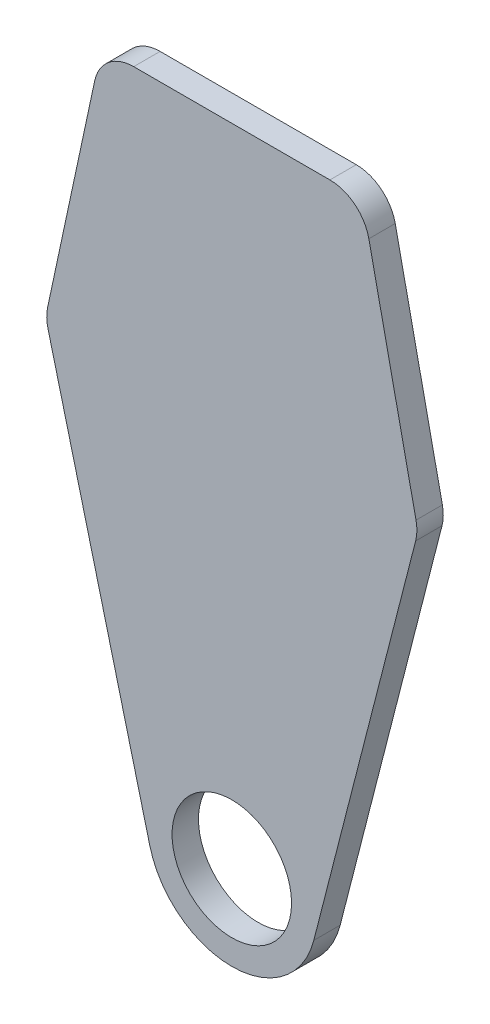
ISO-10303-21;
HEADER;
FILE_DESCRIPTION(('STEP AP214'),'2;1');
FILE_NAME('part.step','',(''),(''),'','','');
FILE_SCHEMA(('AUTOMOTIVE_DESIGN { 1 0 10303 214 1 1 1 1 }'));
ENDSEC;
DATA;
#1=APPLICATION_CONTEXT('core data for automotive mechanical design processes');
#2=APPLICATION_PROTOCOL_DEFINITION('international standard','automotive_design',2000,#1);
#3=PRODUCT_CONTEXT('',#1,'mechanical');
#4=PRODUCT('Part','Part','',(#3));
#5=PRODUCT_RELATED_PRODUCT_CATEGORY('part','',(#4));
#6=PRODUCT_DEFINITION_FORMATION('','',#4);
#7=PRODUCT_DEFINITION_CONTEXT('part definition',#1,'design');
#8=PRODUCT_DEFINITION('design','',#6,#7);
#9=PRODUCT_DEFINITION_SHAPE('','',#8);
#10=(LENGTH_UNIT() NAMED_UNIT(*) SI_UNIT(.MILLI.,.METRE.));
#11=(NAMED_UNIT(*) PLANE_ANGLE_UNIT() SI_UNIT($,.RADIAN.));
#12=(NAMED_UNIT(*) SI_UNIT($,.STERADIAN.) SOLID_ANGLE_UNIT());
#13=UNCERTAINTY_MEASURE_WITH_UNIT(LENGTH_MEASURE(1.E-05),#10,'distance_accuracy_value','');
#14=(GEOMETRIC_REPRESENTATION_CONTEXT(3) GLOBAL_UNCERTAINTY_ASSIGNED_CONTEXT((#13)) GLOBAL_UNIT_ASSIGNED_CONTEXT((#10,
#11,#12)) REPRESENTATION_CONTEXT('',''));
#15=CARTESIAN_POINT('',(0.,0.,0.));
#16=DIRECTION('',(0.,0.,1.));
#17=DIRECTION('',(1.,0.,0.));
#18=AXIS2_PLACEMENT_3D('',#15,#16,#17);
#19=CARTESIAN_POINT('',(0.,0.,6.731));
#20=DIRECTION('',(0.,0.,1.));
#21=DIRECTION('',(1.,0.,0.));
#22=AXIS2_PLACEMENT_3D('',#19,#20,#21);
#23=PLANE('',#22);
#24=DIRECTION('',(1.,0.,0.));
#25=VECTOR('',#24,1.);
#26=CARTESIAN_POINT('',(-33.2359,164.676666666667,6.731));
#27=LINE('',#26,#25);
#28=CARTESIAN_POINT('',(-25.0221764756321,164.676666666667,6.731));
#29=VERTEX_POINT('',#28);
#30=CARTESIAN_POINT('',(25.0221764756321,164.676666666667,6.731));
#31=VERTEX_POINT('',#30);
#32=EDGE_CURVE('E197',#29,#31,#27,.T.);
#33=ORIENTED_EDGE('',*,*,#32,.F.);
#34=CARTESIAN_POINT('',(-25.0221764756321,154.516666666667,6.731));
#35=DIRECTION('',(0.,0.,1.));
#36=DIRECTION('',(1.,0.,0.));
#37=AXIS2_PLACEMENT_3D('',#34,#35,#36);
#38=CIRCLE('',#37,10.16);
#39=CARTESIAN_POINT('',(-34.9567045244241,156.645223090106,6.731));
#40=VERTEX_POINT('',#39);
#41=EDGE_CURVE('E63',#29,#40,#38,.T.);
#42=ORIENTED_EDGE('',*,*,#41,.T.);
#43=DIRECTION('',(-0.209503584984198,-0.977807878818109,0.));
#44=VECTOR('',#43,1.);
#45=CARTESIAN_POINT('',(-33.2359,164.676666666667,6.731));
#46=LINE('',#45,#44);
#47=CARTESIAN_POINT('',(-46.9843357283268,100.509130929289,6.731));
#48=VERTEX_POINT('',#47);
#49=EDGE_CURVE('E158',#40,#48,#46,.T.);
#50=ORIENTED_EDGE('',*,*,#49,.T.);
#51=CARTESIAN_POINT('',(-37.0498076795348,98.3805745058493,6.731));
#52=DIRECTION('',(0.,0.,1.));
#53=DIRECTION('',(1.,0.,0.));
#54=AXIS2_PLACEMENT_3D('',#51,#52,#53);
#55=CIRCLE('',#54,10.16);
#56=CARTESIAN_POINT('',(-46.8908648252877,95.8548678217652,6.731));
#57=VERTEX_POINT('',#56);
#58=EDGE_CURVE('E177',#48,#57,#55,.T.);
#59=ORIENTED_EDGE('',*,*,#58,.T.);
#60=DIRECTION('',(0.24859317756733,-0.968607986786697,0.));
#61=VECTOR('',#60,1.);
#62=CARTESIAN_POINT('',(-47.4853,98.171,6.731));
#63=LINE('',#62,#61);
#64=CARTESIAN_POINT('',(-20.9122464347248,-5.36712670367865,6.731));
#65=VERTEX_POINT('',#64);
#66=EDGE_CURVE('E149',#57,#65,#63,.T.);
#67=ORIENTED_EDGE('',*,*,#66,.T.);
#68=CARTESIAN_POINT('',(0.,0.,6.731));
#69=DIRECTION('',(0.,0.,1.));
#70=DIRECTION('',(1.,0.,0.));
#71=AXIS2_PLACEMENT_3D('',#68,#69,#70);
#72=CIRCLE('',#71,21.59);
#73=CARTESIAN_POINT('',(20.9122464347248,-5.36712670367866,6.731));
#74=VERTEX_POINT('',#73);
#75=EDGE_CURVE('E143',#65,#74,#72,.T.);
#76=ORIENTED_EDGE('',*,*,#75,.T.);
#77=DIRECTION('',(-0.24859317756733,-0.968607986786697,0.));
#78=VECTOR('',#77,1.);
#79=CARTESIAN_POINT('',(47.4853,98.171,6.731));
#80=LINE('',#79,#78);
#81=CARTESIAN_POINT('',(46.8908648252877,95.8548678217652,6.731));
#82=VERTEX_POINT('',#81);
#83=EDGE_CURVE('E132',#82,#74,#80,.T.);
#84=ORIENTED_EDGE('',*,*,#83,.F.);
#85=CARTESIAN_POINT('',(37.0498076795348,98.3805745058493,6.731));
#86=DIRECTION('',(0.,0.,1.));
#87=DIRECTION('',(1.,0.,0.));
#88=AXIS2_PLACEMENT_3D('',#85,#86,#87);
#89=CIRCLE('',#88,10.16);
#90=CARTESIAN_POINT('',(46.9843357283268,100.509130929289,6.731));
#91=VERTEX_POINT('',#90);
#92=EDGE_CURVE('E175',#82,#91,#89,.T.);
#93=ORIENTED_EDGE('',*,*,#92,.T.);
#94=DIRECTION('',(0.209503584984198,-0.977807878818109,0.));
#95=VECTOR('',#94,1.);
#96=CARTESIAN_POINT('',(33.2359,164.676666666667,6.731));
#97=LINE('',#96,#95);
#98=CARTESIAN_POINT('',(34.9567045244241,156.645223090106,6.731));
#99=VERTEX_POINT('',#98);
#100=EDGE_CURVE('E144',#99,#91,#97,.T.);
#101=ORIENTED_EDGE('',*,*,#100,.F.);
#102=CARTESIAN_POINT('',(25.0221764756321,154.516666666667,6.731));
#103=DIRECTION('',(0.,0.,1.));
#104=DIRECTION('',(1.,0.,0.));
#105=AXIS2_PLACEMENT_3D('',#102,#103,#104);
#106=CIRCLE('',#105,10.16);
#107=EDGE_CURVE('E75',#99,#31,#106,.T.);
#108=ORIENTED_EDGE('',*,*,#107,.T.);
#109=EDGE_LOOP('',(#33,#42,#50,#59,#67,#76,#84,#93,#101,#108));
#110=FACE_BOUND('',#109,.T.);
#111=CARTESIAN_POINT('',(0.,0.,6.731));
#112=DIRECTION('',(0.,0.,1.));
#113=DIRECTION('',(1.,0.,0.));
#114=AXIS2_PLACEMENT_3D('',#111,#112,#113);
#115=CIRCLE('',#114,15.24);
#116=CARTESIAN_POINT('',(15.24,0.,6.731));
#117=VERTEX_POINT('',#116);
#118=EDGE_CURVE('E218',#117,#117,#115,.T.);
#119=ORIENTED_EDGE('',*,*,#118,.F.);
#120=EDGE_LOOP('',(#119));
#121=FACE_BOUND('',#120,.T.);
#122=ADVANCED_FACE('F55',(#110,#121),#23,.T.);
#123=CARTESIAN_POINT('',(0.,0.,0.));
#124=DIRECTION('',(0.,0.,1.));
#125=DIRECTION('',(1.,0.,0.));
#126=AXIS2_PLACEMENT_3D('',#123,#124,#125);
#127=PLANE('',#126);
#128=DIRECTION('',(-0.209503584984198,-0.977807878818109,0.));
#129=VECTOR('',#128,1.);
#130=CARTESIAN_POINT('',(-33.2359,164.676666666667,0.));
#131=LINE('',#130,#129);
#132=CARTESIAN_POINT('',(-34.9567045244241,156.645223090106,0.));
#133=VERTEX_POINT('',#132);
#134=CARTESIAN_POINT('',(-46.9843357283268,100.509130929289,0.));
#135=VERTEX_POINT('',#134);
#136=EDGE_CURVE('E213',#133,#135,#131,.T.);
#137=ORIENTED_EDGE('',*,*,#136,.F.);
#138=CARTESIAN_POINT('',(-25.0221764756321,154.516666666667,0.));
#139=DIRECTION('',(0.,0.,1.));
#140=DIRECTION('',(1.,0.,0.));
#141=AXIS2_PLACEMENT_3D('',#138,#139,#140);
#142=CIRCLE('',#141,10.16);
#143=CARTESIAN_POINT('',(-25.0221764756321,164.676666666667,0.));
#144=VERTEX_POINT('',#143);
#145=EDGE_CURVE('E188',#133,#144,#142,.F.);
#146=ORIENTED_EDGE('',*,*,#145,.T.);
#147=DIRECTION('',(1.,0.,0.));
#148=VECTOR('',#147,1.);
#149=CARTESIAN_POINT('',(-33.2359,164.676666666667,0.));
#150=LINE('',#149,#148);
#151=CARTESIAN_POINT('',(25.0221764756321,164.676666666667,0.));
#152=VERTEX_POINT('',#151);
#153=EDGE_CURVE('E212',#144,#152,#150,.T.);
#154=ORIENTED_EDGE('',*,*,#153,.T.);
#155=CARTESIAN_POINT('',(25.0221764756321,154.516666666667,0.));
#156=DIRECTION('',(0.,0.,1.));
#157=DIRECTION('',(1.,0.,0.));
#158=AXIS2_PLACEMENT_3D('',#155,#156,#157);
#159=CIRCLE('',#158,10.16);
#160=CARTESIAN_POINT('',(34.9567045244241,156.645223090106,0.));
#161=VERTEX_POINT('',#160);
#162=EDGE_CURVE('E186',#152,#161,#159,.F.);
#163=ORIENTED_EDGE('',*,*,#162,.T.);
#164=DIRECTION('',(0.209503584984198,-0.977807878818109,0.));
#165=VECTOR('',#164,1.);
#166=CARTESIAN_POINT('',(33.2359,164.676666666667,0.));
#167=LINE('',#166,#165);
#168=CARTESIAN_POINT('',(46.9843357283268,100.509130929289,0.));
#169=VERTEX_POINT('',#168);
#170=EDGE_CURVE('E217',#161,#169,#167,.T.);
#171=ORIENTED_EDGE('',*,*,#170,.T.);
#172=CARTESIAN_POINT('',(37.0498076795348,98.3805745058493,0.));
#173=DIRECTION('',(0.,0.,1.));
#174=DIRECTION('',(1.,0.,0.));
#175=AXIS2_PLACEMENT_3D('',#172,#173,#174);
#176=CIRCLE('',#175,10.16);
#177=CARTESIAN_POINT('',(46.8908648252877,95.8548678217652,0.));
#178=VERTEX_POINT('',#177);
#179=EDGE_CURVE('E167',#169,#178,#176,.F.);
#180=ORIENTED_EDGE('',*,*,#179,.T.);
#181=DIRECTION('',(-0.24859317756733,-0.968607986786697,0.));
#182=VECTOR('',#181,1.);
#183=CARTESIAN_POINT('',(47.4853,98.171,0.));
#184=LINE('',#183,#182);
#185=CARTESIAN_POINT('',(20.9122464347248,-5.36712670367866,0.));
#186=VERTEX_POINT('',#185);
#187=EDGE_CURVE('E220',#178,#186,#184,.T.);
#188=ORIENTED_EDGE('',*,*,#187,.T.);
#189=CARTESIAN_POINT('',(0.,0.,0.));
#190=DIRECTION('',(0.,0.,1.));
#191=DIRECTION('',(1.,0.,0.));
#192=AXIS2_PLACEMENT_3D('',#189,#190,#191);
#193=CIRCLE('',#192,21.59);
#194=CARTESIAN_POINT('',(-20.9122464347248,-5.36712670367865,0.));
#195=VERTEX_POINT('',#194);
#196=EDGE_CURVE('E156',#195,#186,#193,.T.);
#197=ORIENTED_EDGE('',*,*,#196,.F.);
#198=DIRECTION('',(0.24859317756733,-0.968607986786697,0.));
#199=VECTOR('',#198,1.);
#200=CARTESIAN_POINT('',(-47.4853,98.171,0.));
#201=LINE('',#200,#199);
#202=CARTESIAN_POINT('',(-46.8908648252877,95.8548678217652,0.));
#203=VERTEX_POINT('',#202);
#204=EDGE_CURVE('E229',#203,#195,#201,.T.);
#205=ORIENTED_EDGE('',*,*,#204,.F.);
#206=CARTESIAN_POINT('',(-37.0498076795348,98.3805745058493,0.));
#207=DIRECTION('',(0.,0.,1.));
#208=DIRECTION('',(1.,0.,0.));
#209=AXIS2_PLACEMENT_3D('',#206,#207,#208);
#210=CIRCLE('',#209,10.16);
#211=EDGE_CURVE('E169',#203,#135,#210,.F.);
#212=ORIENTED_EDGE('',*,*,#211,.T.);
#213=EDGE_LOOP('',(#137,#146,#154,#163,#171,#180,#188,#197,#205,#212));
#214=FACE_BOUND('',#213,.T.);
#215=CARTESIAN_POINT('',(0.,0.,0.));
#216=DIRECTION('',(0.,0.,1.));
#217=DIRECTION('',(1.,0.,0.));
#218=AXIS2_PLACEMENT_3D('',#215,#216,#217);
#219=CIRCLE('',#218,15.24);
#220=CARTESIAN_POINT('',(15.24,0.,0.));
#221=VERTEX_POINT('',#220);
#222=EDGE_CURVE('E223',#221,#221,#219,.T.);
#223=ORIENTED_EDGE('',*,*,#222,.T.);
#224=EDGE_LOOP('',(#223));
#225=FACE_BOUND('',#224,.T.);
#226=ADVANCED_FACE('F210',(#214,#225),#127,.F.);
#227=CARTESIAN_POINT('',(-33.2359,164.676666666667,6.731));
#228=DIRECTION('',(0.,1.,0.));
#229=DIRECTION('',(0.,0.,1.));
#230=AXIS2_PLACEMENT_3D('',#227,#228,#229);
#231=PLANE('',#230);
#232=ORIENTED_EDGE('',*,*,#153,.F.);
#233=DIRECTION('',(0.,0.,-1.));
#234=VECTOR('',#233,1.);
#235=CARTESIAN_POINT('',(-25.0221764756321,164.676666666667,6.731));
#236=LINE('',#235,#234);
#237=EDGE_CURVE('E193',#144,#29,#236,.F.);
#238=ORIENTED_EDGE('',*,*,#237,.T.);
#239=ORIENTED_EDGE('',*,*,#32,.T.);
#240=DIRECTION('',(0.,0.,-1.));
#241=VECTOR('',#240,1.);
#242=CARTESIAN_POINT('',(25.0221764756321,164.676666666667,6.731));
#243=LINE('',#242,#241);
#244=EDGE_CURVE('E190',#31,#152,#243,.T.);
#245=ORIENTED_EDGE('',*,*,#244,.T.);
#246=EDGE_LOOP('',(#232,#238,#239,#245));
#247=FACE_BOUND('',#246,.T.);
#248=ADVANCED_FACE('F215',(#247),#231,.T.);
#249=CARTESIAN_POINT('',(-33.2359,164.676666666667,6.731));
#250=DIRECTION('',(0.977807878818109,-0.209503584984198,0.));
#251=DIRECTION('',(0.209503584984198,0.977807878818109,0.));
#252=AXIS2_PLACEMENT_3D('',#249,#250,#251);
#253=PLANE('',#252);
#254=ORIENTED_EDGE('',*,*,#49,.F.);
#255=DIRECTION('',(0.,0.,-1.));
#256=VECTOR('',#255,1.);
#257=CARTESIAN_POINT('',(-34.9567045244241,156.645223090106,0.));
#258=LINE('',#257,#256);
#259=EDGE_CURVE('E183',#40,#133,#258,.T.);
#260=ORIENTED_EDGE('',*,*,#259,.T.);
#261=ORIENTED_EDGE('',*,*,#136,.T.);
#262=DIRECTION('',(0.,0.,-1.));
#263=VECTOR('',#262,1.);
#264=CARTESIAN_POINT('',(-46.9843357283268,100.509130929289,6.731));
#265=LINE('',#264,#263);
#266=EDGE_CURVE('E172',#135,#48,#265,.F.);
#267=ORIENTED_EDGE('',*,*,#266,.T.);
#268=EDGE_LOOP('',(#254,#260,#261,#267));
#269=FACE_BOUND('',#268,.T.);
#270=ADVANCED_FACE('F202',(#269),#253,.F.);
#271=CARTESIAN_POINT('',(-47.4853,98.171,6.731));
#272=DIRECTION('',(0.968607986786697,0.24859317756733,0.));
#273=DIRECTION('',(-0.24859317756733,0.968607986786697,0.));
#274=AXIS2_PLACEMENT_3D('',#271,#272,#273);
#275=PLANE('',#274);
#276=ORIENTED_EDGE('',*,*,#66,.F.);
#277=DIRECTION('',(0.,0.,-1.));
#278=VECTOR('',#277,1.);
#279=CARTESIAN_POINT('',(-46.8908648252877,95.8548678217652,6.731));
#280=LINE('',#279,#278);
#281=EDGE_CURVE('E160',#57,#203,#280,.T.);
#282=ORIENTED_EDGE('',*,*,#281,.T.);
#283=ORIENTED_EDGE('',*,*,#204,.T.);
#284=DIRECTION('',(0.,0.,-1.));
#285=VECTOR('',#284,1.);
#286=CARTESIAN_POINT('',(-20.9122464347248,-5.36712670367865,6.731));
#287=LINE('',#286,#285);
#288=EDGE_CURVE('E157',#65,#195,#287,.T.);
#289=ORIENTED_EDGE('',*,*,#288,.F.);
#290=EDGE_LOOP('',(#276,#282,#283,#289));
#291=FACE_BOUND('',#290,.T.);
#292=ADVANCED_FACE('F259',(#291),#275,.F.);
#293=CARTESIAN_POINT('',(0.,0.,6.731));
#294=DIRECTION('',(0.,0.,-1.));
#295=DIRECTION('',(-1.,0.,0.));
#296=AXIS2_PLACEMENT_3D('',#293,#294,#295);
#297=CYLINDRICAL_SURFACE('',#296,21.59);
#298=ORIENTED_EDGE('',*,*,#196,.T.);
#299=DIRECTION('',(0.,0.,-1.));
#300=VECTOR('',#299,1.);
#301=CARTESIAN_POINT('',(20.9122464347248,-5.36712670367866,6.731));
#302=LINE('',#301,#300);
#303=EDGE_CURVE('E137',#74,#186,#302,.T.);
#304=ORIENTED_EDGE('',*,*,#303,.F.);
#305=ORIENTED_EDGE('',*,*,#75,.F.);
#306=ORIENTED_EDGE('',*,*,#288,.T.);
#307=EDGE_LOOP('',(#298,#304,#305,#306));
#308=FACE_BOUND('',#307,.T.);
#309=ADVANCED_FACE('F154',(#308),#297,.T.);
#310=CARTESIAN_POINT('',(47.4853,98.171,6.731));
#311=DIRECTION('',(0.968607986786697,-0.24859317756733,0.));
#312=DIRECTION('',(0.24859317756733,0.968607986786697,0.));
#313=AXIS2_PLACEMENT_3D('',#310,#311,#312);
#314=PLANE('',#313);
#315=ORIENTED_EDGE('',*,*,#187,.F.);
#316=DIRECTION('',(0.,0.,-1.));
#317=VECTOR('',#316,1.);
#318=CARTESIAN_POINT('',(46.8908648252877,95.8548678217652,6.731));
#319=LINE('',#318,#317);
#320=EDGE_CURVE('E140',#178,#82,#319,.F.);
#321=ORIENTED_EDGE('',*,*,#320,.T.);
#322=ORIENTED_EDGE('',*,*,#83,.T.);
#323=ORIENTED_EDGE('',*,*,#303,.T.);
#324=EDGE_LOOP('',(#315,#321,#322,#323));
#325=FACE_BOUND('',#324,.T.);
#326=ADVANCED_FACE('F135',(#325),#314,.T.);
#327=CARTESIAN_POINT('',(33.2359,164.676666666667,6.731));
#328=DIRECTION('',(0.977807878818109,0.209503584984198,0.));
#329=DIRECTION('',(-0.209503584984198,0.977807878818109,0.));
#330=AXIS2_PLACEMENT_3D('',#327,#328,#329);
#331=PLANE('',#330);
#332=ORIENTED_EDGE('',*,*,#170,.F.);
#333=DIRECTION('',(0.,0.,-1.));
#334=VECTOR('',#333,1.);
#335=CARTESIAN_POINT('',(34.9567045244241,156.645223090106,6.731));
#336=LINE('',#335,#334);
#337=EDGE_CURVE('E12',#161,#99,#336,.F.);
#338=ORIENTED_EDGE('',*,*,#337,.T.);
#339=ORIENTED_EDGE('',*,*,#100,.T.);
#340=DIRECTION('',(0.,0.,-1.));
#341=VECTOR('',#340,1.);
#342=CARTESIAN_POINT('',(46.9843357283268,100.509130929289,6.731));
#343=LINE('',#342,#341);
#344=EDGE_CURVE('E179',#91,#169,#343,.T.);
#345=ORIENTED_EDGE('',*,*,#344,.T.);
#346=EDGE_LOOP('',(#332,#338,#339,#345));
#347=FACE_BOUND('',#346,.T.);
#348=ADVANCED_FACE('F239',(#347),#331,.T.);
#349=CARTESIAN_POINT('',(0.,0.,6.731));
#350=DIRECTION('',(0.,0.,-1.));
#351=DIRECTION('',(-1.,0.,0.));
#352=AXIS2_PLACEMENT_3D('',#349,#350,#351);
#353=CYLINDRICAL_SURFACE('',#352,15.24);
#354=ORIENTED_EDGE('',*,*,#118,.T.);
#355=EDGE_LOOP('',(#354));
#356=FACE_BOUND('',#355,.T.);
#357=ORIENTED_EDGE('',*,*,#222,.F.);
#358=EDGE_LOOP('',(#357));
#359=FACE_BOUND('',#358,.T.);
#360=ADVANCED_FACE('F236',(#356,#359),#353,.F.);
#361=CARTESIAN_POINT('',(-37.0498076795348,98.3805745058493,6.731));
#362=DIRECTION('',(0.,0.,-1.));
#363=DIRECTION('',(-1.,0.,0.));
#364=AXIS2_PLACEMENT_3D('',#361,#362,#363);
#365=CYLINDRICAL_SURFACE('',#364,10.16);
#366=ORIENTED_EDGE('',*,*,#58,.F.);
#367=ORIENTED_EDGE('',*,*,#266,.F.);
#368=ORIENTED_EDGE('',*,*,#211,.F.);
#369=ORIENTED_EDGE('',*,*,#281,.F.);
#370=EDGE_LOOP('',(#366,#367,#368,#369));
#371=FACE_BOUND('',#370,.T.);
#372=ADVANCED_FACE('F238',(#371),#365,.T.);
#373=CARTESIAN_POINT('',(37.0498076795348,98.3805745058493,6.731));
#374=DIRECTION('',(0.,0.,-1.));
#375=DIRECTION('',(-1.,0.,0.));
#376=AXIS2_PLACEMENT_3D('',#373,#374,#375);
#377=CYLINDRICAL_SURFACE('',#376,10.16);
#378=ORIENTED_EDGE('',*,*,#92,.F.);
#379=ORIENTED_EDGE('',*,*,#320,.F.);
#380=ORIENTED_EDGE('',*,*,#179,.F.);
#381=ORIENTED_EDGE('',*,*,#344,.F.);
#382=EDGE_LOOP('',(#378,#379,#380,#381));
#383=FACE_BOUND('',#382,.T.);
#384=ADVANCED_FACE('F246',(#383),#377,.T.);
#385=CARTESIAN_POINT('',(-25.0221764756321,154.516666666667,6.731));
#386=DIRECTION('',(0.,0.,1.));
#387=DIRECTION('',(1.,0.,0.));
#388=AXIS2_PLACEMENT_3D('',#385,#386,#387);
#389=CYLINDRICAL_SURFACE('',#388,10.16);
#390=ORIENTED_EDGE('',*,*,#41,.F.);
#391=ORIENTED_EDGE('',*,*,#237,.F.);
#392=ORIENTED_EDGE('',*,*,#145,.F.);
#393=ORIENTED_EDGE('',*,*,#259,.F.);
#394=EDGE_LOOP('',(#390,#391,#392,#393));
#395=FACE_BOUND('',#394,.T.);
#396=ADVANCED_FACE('F206',(#395),#389,.T.);
#397=CARTESIAN_POINT('',(25.0221764756321,154.516666666667,6.731));
#398=DIRECTION('',(0.,0.,-1.));
#399=DIRECTION('',(-1.,0.,0.));
#400=AXIS2_PLACEMENT_3D('',#397,#398,#399);
#401=CYLINDRICAL_SURFACE('',#400,10.16);
#402=ORIENTED_EDGE('',*,*,#107,.F.);
#403=ORIENTED_EDGE('',*,*,#337,.F.);
#404=ORIENTED_EDGE('',*,*,#162,.F.);
#405=ORIENTED_EDGE('',*,*,#244,.F.);
#406=EDGE_LOOP('',(#402,#403,#404,#405));
#407=FACE_BOUND('',#406,.T.);
#408=ADVANCED_FACE('F57',(#407),#401,.T.);
#409=CLOSED_SHELL('',(#122,#226,#248,#270,#292,#309,#326,#348,#360,#372,#384,#396,#408));
#410=MANIFOLD_SOLID_BREP('B2',#409);
#411=ADVANCED_BREP_SHAPE_REPRESENTATION('',(#18,#410),#14);
#412=SHAPE_DEFINITION_REPRESENTATION(#9,#411);
ENDSEC;
END-ISO-10303-21;
